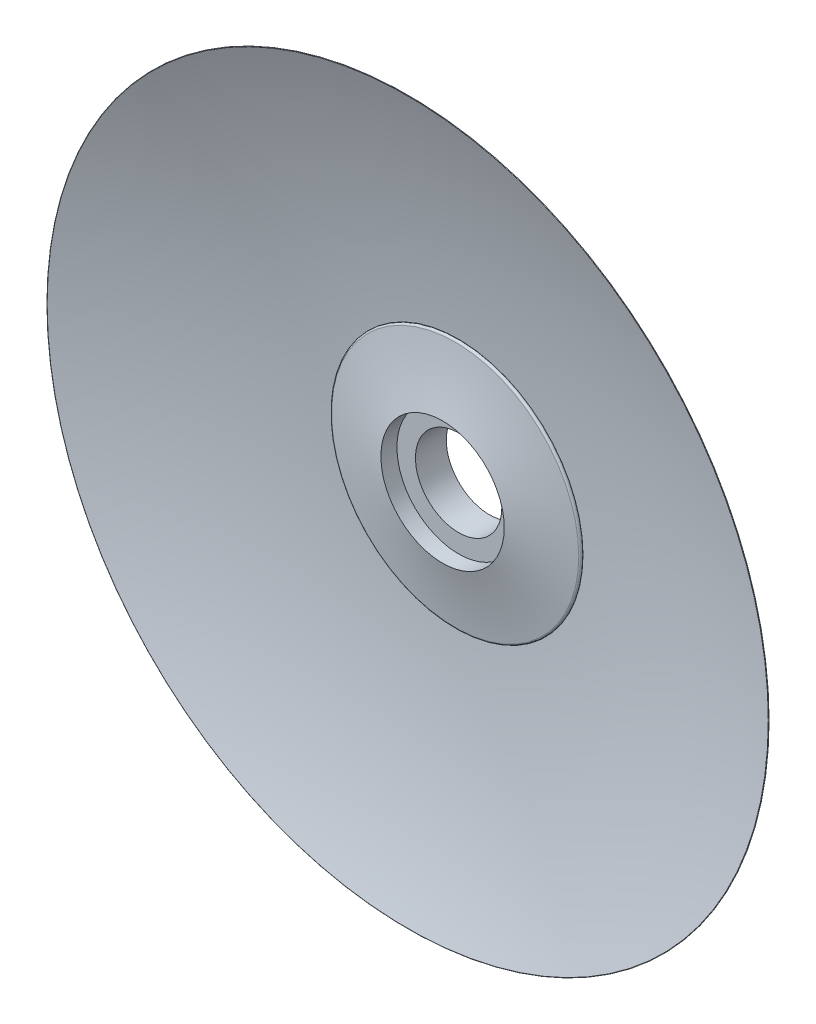
ISO-10303-21;
HEADER;
FILE_DESCRIPTION(('STEP AP214'),'2;1');
FILE_NAME('part.step','',(''),(''),'','','');
FILE_SCHEMA(('AUTOMOTIVE_DESIGN { 1 0 10303 214 1 1 1 1 }'));
ENDSEC;
DATA;
#1=APPLICATION_CONTEXT('core data for automotive mechanical design processes');
#2=APPLICATION_PROTOCOL_DEFINITION('international standard','automotive_design',2000,#1);
#3=PRODUCT_CONTEXT('',#1,'mechanical');
#4=PRODUCT('Part','Part','',(#3));
#5=PRODUCT_RELATED_PRODUCT_CATEGORY('part','',(#4));
#6=PRODUCT_DEFINITION_FORMATION('','',#4);
#7=PRODUCT_DEFINITION_CONTEXT('part definition',#1,'design');
#8=PRODUCT_DEFINITION('design','',#6,#7);
#9=PRODUCT_DEFINITION_SHAPE('','',#8);
#10=(LENGTH_UNIT() NAMED_UNIT(*) SI_UNIT(.MILLI.,.METRE.));
#11=(NAMED_UNIT(*) PLANE_ANGLE_UNIT() SI_UNIT($,.RADIAN.));
#12=(NAMED_UNIT(*) SI_UNIT($,.STERADIAN.) SOLID_ANGLE_UNIT());
#13=UNCERTAINTY_MEASURE_WITH_UNIT(LENGTH_MEASURE(1.E-05),#10,'distance_accuracy_value','');
#14=(GEOMETRIC_REPRESENTATION_CONTEXT(3) GLOBAL_UNCERTAINTY_ASSIGNED_CONTEXT((#13)) GLOBAL_UNIT_ASSIGNED_CONTEXT((#10,
#11,#12)) REPRESENTATION_CONTEXT('',''));
#15=CARTESIAN_POINT('',(0.,0.,0.));
#16=DIRECTION('',(0.,0.,1.));
#17=DIRECTION('',(1.,0.,0.));
#18=AXIS2_PLACEMENT_3D('',#15,#16,#17);
#19=CARTESIAN_POINT('',(0.,0.,-44.6729594520743));
#20=DIRECTION('',(0.,0.,1.));
#21=DIRECTION('',(1.,0.,0.));
#22=AXIS2_PLACEMENT_3D('',#19,#20,#21);
#23=CYLINDRICAL_SURFACE('',#22,7.);
#24=CARTESIAN_POINT('',(0.,0.,-74.2729594520743));
#25=DIRECTION('',(0.,0.,1.));
#26=DIRECTION('',(1.,0.,0.));
#27=AXIS2_PLACEMENT_3D('',#24,#25,#26);
#28=CIRCLE('',#27,7.);
#29=CARTESIAN_POINT('',(7.,0.,-74.2729594520743));
#30=VERTEX_POINT('',#29);
#31=EDGE_CURVE('E10',#30,#30,#28,.T.);
#32=ORIENTED_EDGE('',*,*,#31,.F.);
#33=EDGE_LOOP('',(#32));
#34=FACE_BOUND('',#33,.T.);
#35=CARTESIAN_POINT('',(0.,0.,-69.2729594520743));
#36=DIRECTION('',(0.,0.,1.));
#37=DIRECTION('',(1.,0.,0.));
#38=AXIS2_PLACEMENT_3D('',#35,#36,#37);
#39=CIRCLE('',#38,7.);
#40=CARTESIAN_POINT('',(7.,0.,-69.2729594520743));
#41=VERTEX_POINT('',#40);
#42=EDGE_CURVE('E44',#41,#41,#39,.F.);
#43=ORIENTED_EDGE('',*,*,#42,.F.);
#44=EDGE_LOOP('',(#43));
#45=FACE_BOUND('',#44,.T.);
#46=ADVANCED_FACE('F41',(#34,#45),#23,.F.);
#47=CARTESIAN_POINT('',(0.,0.,-74.2729594520743));
#48=DIRECTION('',(0.,0.,1.));
#49=DIRECTION('',(1.,0.,0.));
#50=AXIS2_PLACEMENT_3D('',#47,#48,#49);
#51=PLANE('',#50);
#52=CARTESIAN_POINT('',(0.,0.,-74.2729594520743));
#53=DIRECTION('',(0.,0.,1.));
#54=DIRECTION('',(1.,0.,0.));
#55=AXIS2_PLACEMENT_3D('',#52,#53,#54);
#56=CIRCLE('',#55,10.);
#57=CARTESIAN_POINT('',(10.,0.,-74.2729594520743));
#58=VERTEX_POINT('',#57);
#59=EDGE_CURVE('E49',#58,#58,#56,.T.);
#60=ORIENTED_EDGE('',*,*,#59,.F.);
#61=EDGE_LOOP('',(#60));
#62=FACE_BOUND('',#61,.T.);
#63=ORIENTED_EDGE('',*,*,#31,.T.);
#64=EDGE_LOOP('',(#63));
#65=FACE_BOUND('',#64,.T.);
#66=ADVANCED_FACE('F118',(#62,#65),#51,.F.);
#67=CARTESIAN_POINT('',(0.,0.,27.8210098074504));
#68=DIRECTION('',(0.,0.,1.));
#69=DIRECTION('',(1.,0.,0.));
#70=AXIS2_PLACEMENT_3D('',#67,#68,#69);
#71=DEGENERATE_TOROIDAL_SURFACE('',#70,3.63163382853341,103.,.F.);
#72=ORIENTED_EDGE('',*,*,#59,.T.);
#73=EDGE_LOOP('',(#72));
#74=FACE_BOUND('',#73,.T.);
#75=CARTESIAN_POINT('',(0.,0.,-70.7986083421022));
#76=DIRECTION('',(0.,0.,1.));
#77=DIRECTION('',(1.,0.,0.));
#78=AXIS2_PLACEMENT_3D('',#75,#76,#77);
#79=CIRCLE('',#78,26.0865578398107);
#80=CARTESIAN_POINT('',(26.0865578398107,0.,-70.7986083421022));
#81=VERTEX_POINT('',#80);
#82=EDGE_CURVE('E54',#81,#81,#79,.T.);
#83=ORIENTED_EDGE('',*,*,#82,.F.);
#84=EDGE_LOOP('',(#83));
#85=FACE_BOUND('',#84,.T.);
#86=ADVANCED_FACE('F113',(#74,#85),#71,.F.);
#87=CARTESIAN_POINT('',(0.,0.,-70.5113667358413));
#88=DIRECTION('',(0.,0.,1.));
#89=DIRECTION('',(1.,0.,0.));
#90=AXIS2_PLACEMENT_3D('',#87,#88,#89);
#91=TOROIDAL_SURFACE('',#90,26.,0.299999999999971);
#92=CARTESIAN_POINT('',(0.,0.,-70.2139965161136));
#93=DIRECTION('',(0.,0.,1.));
#94=DIRECTION('',(1.,0.,0.));
#95=AXIS2_PLACEMENT_3D('',#92,#93,#94);
#96=CIRCLE('',#95,25.9603647578652);
#97=CARTESIAN_POINT('',(25.9603647578652,0.,-70.2139965161136));
#98=VERTEX_POINT('',#97);
#99=EDGE_CURVE('E60',#98,#98,#96,.T.);
#100=ORIENTED_EDGE('',*,*,#99,.F.);
#101=EDGE_LOOP('',(#100));
#102=FACE_BOUND('',#101,.T.);
#103=ORIENTED_EDGE('',*,*,#82,.T.);
#104=EDGE_LOOP('',(#103));
#105=FACE_BOUND('',#104,.T.);
#106=ADVANCED_FACE('F107',(#102,#105),#91,.T.);
#107=CARTESIAN_POINT('',(0.,0.,-69.0145899865273));
#108=DIRECTION('',(0.,0.,1.));
#109=DIRECTION('',(1.,0.,0.));
#110=AXIS2_PLACEMENT_3D('',#107,#108,#109);
#111=TOROIDAL_SURFACE('',#110,20.,0.300000000000006);
#112=CARTESIAN_POINT('',(0.,0.,-69.3138204028504));
#113=DIRECTION('',(0.,0.,1.));
#114=DIRECTION('',(1.,0.,0.));
#115=AXIS2_PLACEMENT_3D('',#112,#113,#114);
#116=CIRCLE('',#115,20.0214745884037);
#117=CARTESIAN_POINT('',(20.0214745884037,0.,-69.3138204028504));
#118=VERTEX_POINT('',#117);
#119=EDGE_CURVE('E68',#118,#118,#116,.F.);
#120=ORIENTED_EDGE('',*,*,#119,.F.);
#121=EDGE_LOOP('',(#120));
#122=FACE_BOUND('',#121,.T.);
#123=CARTESIAN_POINT('',(0.,0.,-68.7173918267059));
#124=DIRECTION('',(0.,0.,1.));
#125=DIRECTION('',(1.,0.,0.));
#126=AXIS2_PLACEMENT_3D('',#123,#124,#125);
#127=CIRCLE('',#126,20.0409054250529);
#128=CARTESIAN_POINT('',(20.0409054250529,0.,-68.7173918267059));
#129=VERTEX_POINT('',#128);
#130=EDGE_CURVE('E64',#129,#129,#127,.T.);
#131=ORIENTED_EDGE('',*,*,#130,.F.);
#132=EDGE_LOOP('',(#131));
#133=FACE_BOUND('',#132,.T.);
#134=ADVANCED_FACE('F102',(#122,#133),#111,.T.);
#135=CARTESIAN_POINT('',(0.,0.,10.5354507923422));
#136=DIRECTION('',(0.,0.,1.));
#137=DIRECTION('',(1.,0.,0.));
#138=AXIS2_PLACEMENT_3D('',#135,#136,#137);
#139=DEGENERATE_TOROIDAL_SURFACE('',#138,30.9490187724841,80.,.T.);
#140=CARTESIAN_POINT('',(0.,0.,-66.6729594520743));
#141=DIRECTION('',(0.,0.,1.));
#142=DIRECTION('',(1.,0.,0.));
#143=AXIS2_PLACEMENT_3D('',#140,#141,#142);
#144=CIRCLE('',#143,10.);
#145=CARTESIAN_POINT('',(10.,0.,-66.6729594520743));
#146=VERTEX_POINT('',#145);
#147=EDGE_CURVE('E80',#146,#146,#144,.F.);
#148=ORIENTED_EDGE('',*,*,#147,.T.);
#149=EDGE_LOOP('',(#148));
#150=FACE_BOUND('',#149,.T.);
#151=ORIENTED_EDGE('',*,*,#130,.T.);
#152=EDGE_LOOP('',(#151));
#153=FACE_BOUND('',#152,.T.);
#154=ADVANCED_FACE('F98',(#150,#153),#139,.F.);
#155=CARTESIAN_POINT('',(0.,0.,49.5313845978598));
#156=DIRECTION('',(0.,0.,1.));
#157=DIRECTION('',(1.,0.,0.));
#158=AXIS2_PLACEMENT_3D('',#155,#156,#157);
#159=DEGENERATE_TOROIDAL_SURFACE('',#158,10.,120.804344049934,.T.);
#160=CARTESIAN_POINT('',(0.,0.,-61.1127870209947));
#161=DIRECTION('',(0.,0.,1.));
#162=DIRECTION('',(1.,0.,0.));
#163=AXIS2_PLACEMENT_3D('',#160,#161,#162);
#164=CIRCLE('',#163,58.4928533715262);
#165=CARTESIAN_POINT('',(58.4928533715262,0.,-61.1127870209947));
#166=VERTEX_POINT('',#165);
#167=EDGE_CURVE('E76',#166,#166,#164,.T.);
#168=ORIENTED_EDGE('',*,*,#167,.F.);
#169=EDGE_LOOP('',(#168));
#170=FACE_BOUND('',#169,.T.);
#171=ORIENTED_EDGE('',*,*,#99,.T.);
#172=EDGE_LOOP('',(#171));
#173=FACE_BOUND('',#172,.T.);
#174=ADVANCED_FACE('F101',(#170,#173),#159,.T.);
#175=CARTESIAN_POINT('',(0.,0.,-61.0669922391559));
#176=DIRECTION('',(0.,0.,1.));
#177=DIRECTION('',(1.,0.,0.));
#178=AXIS2_PLACEMENT_3D('',#175,#176,#177);
#179=TOROIDAL_SURFACE('',#178,58.4727825480169,0.0499999999999882);
#180=ORIENTED_EDGE('',*,*,#167,.T.);
#181=EDGE_LOOP('',(#180));
#182=FACE_BOUND('',#181,.T.);
#183=CARTESIAN_POINT('',(0.,0.,-61.0200825523344));
#184=DIRECTION('',(0.,0.,1.));
#185=DIRECTION('',(1.,0.,0.));
#186=AXIS2_PLACEMENT_3D('',#183,#184,#185);
#187=CIRCLE('',#186,58.4554770205096);
#188=CARTESIAN_POINT('',(58.4554770205096,0.,-61.0200825523344));
#189=VERTEX_POINT('',#188);
#190=EDGE_CURVE('E72',#189,#189,#187,.T.);
#191=ORIENTED_EDGE('',*,*,#190,.F.);
#192=EDGE_LOOP('',(#191));
#193=FACE_BOUND('',#192,.T.);
#194=ADVANCED_FACE('F134',(#182,#193),#179,.T.);
#195=CARTESIAN_POINT('',(0.,0.,70.3270405479257));
#196=DIRECTION('',(0.,0.,1.));
#197=DIRECTION('',(1.,0.,0.));
#198=AXIS2_PLACEMENT_3D('',#195,#196,#197);
#199=DEGENERATE_TOROIDAL_SURFACE('',#198,10.,140.,.T.);
#200=ORIENTED_EDGE('',*,*,#119,.T.);
#201=EDGE_LOOP('',(#200));
#202=FACE_BOUND('',#201,.T.);
#203=ORIENTED_EDGE('',*,*,#190,.T.);
#204=EDGE_LOOP('',(#203));
#205=FACE_BOUND('',#204,.T.);
#206=ADVANCED_FACE('F129',(#202,#205),#199,.F.);
#207=CARTESIAN_POINT('',(0.,0.,-69.2729594520743));
#208=DIRECTION('',(0.,0.,1.));
#209=DIRECTION('',(1.,0.,0.));
#210=AXIS2_PLACEMENT_3D('',#207,#208,#209);
#211=PLANE('',#210);
#212=CARTESIAN_POINT('',(0.,0.,-69.2729594520743));
#213=DIRECTION('',(0.,0.,1.));
#214=DIRECTION('',(1.,0.,0.));
#215=AXIS2_PLACEMENT_3D('',#212,#213,#214);
#216=CIRCLE('',#215,10.);
#217=CARTESIAN_POINT('',(10.,0.,-69.2729594520743));
#218=VERTEX_POINT('',#217);
#219=EDGE_CURVE('E84',#218,#218,#216,.T.);
#220=ORIENTED_EDGE('',*,*,#219,.T.);
#221=EDGE_LOOP('',(#220));
#222=FACE_BOUND('',#221,.T.);
#223=ORIENTED_EDGE('',*,*,#42,.T.);
#224=EDGE_LOOP('',(#223));
#225=FACE_BOUND('',#224,.T.);
#226=ADVANCED_FACE('F89',(#222,#225),#211,.T.);
#227=CARTESIAN_POINT('',(0.,0.,-69.2729594520743));
#228=DIRECTION('',(0.,0.,1.));
#229=DIRECTION('',(1.,0.,0.));
#230=AXIS2_PLACEMENT_3D('',#227,#228,#229);
#231=CYLINDRICAL_SURFACE('',#230,10.);
#232=ORIENTED_EDGE('',*,*,#219,.F.);
#233=EDGE_LOOP('',(#232));
#234=FACE_BOUND('',#233,.T.);
#235=ORIENTED_EDGE('',*,*,#147,.F.);
#236=EDGE_LOOP('',(#235));
#237=FACE_BOUND('',#236,.T.);
#238=ADVANCED_FACE('F92',(#234,#237),#231,.F.);
#239=CLOSED_SHELL('',(#46,#66,#86,#106,#134,#154,#174,#194,#206,#226,#238));
#240=MANIFOLD_SOLID_BREP('B2',#239);
#241=ADVANCED_BREP_SHAPE_REPRESENTATION('',(#18,#240),#14);
#242=SHAPE_DEFINITION_REPRESENTATION(#9,#241);
ENDSEC;
END-ISO-10303-21;
